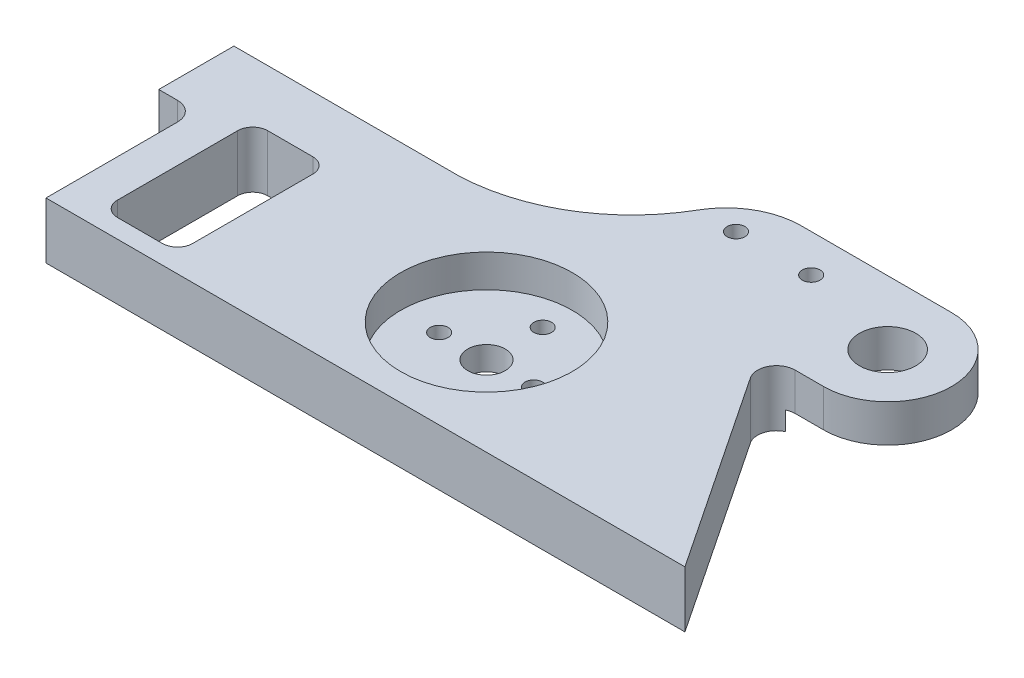
ISO-10303-21;
HEADER;
FILE_DESCRIPTION(('STEP AP214'),'2;1');
FILE_NAME('part.step','',(''),(''),'','','');
FILE_SCHEMA(('AUTOMOTIVE_DESIGN { 1 0 10303 214 1 1 1 1 }'));
ENDSEC;
DATA;
#1=APPLICATION_CONTEXT('core data for automotive mechanical design processes');
#2=APPLICATION_PROTOCOL_DEFINITION('international standard','automotive_design',2000,#1);
#3=PRODUCT_CONTEXT('',#1,'mechanical');
#4=PRODUCT('Part','Part','',(#3));
#5=PRODUCT_RELATED_PRODUCT_CATEGORY('part','',(#4));
#6=PRODUCT_DEFINITION_FORMATION('','',#4);
#7=PRODUCT_DEFINITION_CONTEXT('part definition',#1,'design');
#8=PRODUCT_DEFINITION('design','',#6,#7);
#9=PRODUCT_DEFINITION_SHAPE('','',#8);
#10=(LENGTH_UNIT() NAMED_UNIT(*) SI_UNIT(.MILLI.,.METRE.));
#11=(NAMED_UNIT(*) PLANE_ANGLE_UNIT() SI_UNIT($,.RADIAN.));
#12=(NAMED_UNIT(*) SI_UNIT($,.STERADIAN.) SOLID_ANGLE_UNIT());
#13=UNCERTAINTY_MEASURE_WITH_UNIT(LENGTH_MEASURE(1.E-05),#10,'distance_accuracy_value','');
#14=(GEOMETRIC_REPRESENTATION_CONTEXT(3) GLOBAL_UNCERTAINTY_ASSIGNED_CONTEXT((#13)) GLOBAL_UNIT_ASSIGNED_CONTEXT((#10,
#11,#12)) REPRESENTATION_CONTEXT('',''));
#15=CARTESIAN_POINT('',(0.,0.,0.));
#16=DIRECTION('',(0.,0.,1.));
#17=DIRECTION('',(1.,0.,0.));
#18=AXIS2_PLACEMENT_3D('',#15,#16,#17);
#19=CARTESIAN_POINT('',(99.6289220182295,9.525,-21.6319864480231));
#20=DIRECTION('',(0.,0.,1.));
#21=DIRECTION('',(1.,0.,0.));
#22=AXIS2_PLACEMENT_3D('',#19,#20,#21);
#23=PLANE('',#22);
#24=DIRECTION('',(0.,-1.,0.));
#25=VECTOR('',#24,1.);
#26=CARTESIAN_POINT('',(92.9727751915635,3.175,-21.6319864480231));
#27=LINE('',#26,#25);
#28=CARTESIAN_POINT('',(92.9727751915635,0.,-21.6319864480231));
#29=VERTEX_POINT('',#28);
#30=CARTESIAN_POINT('',(92.9727751915635,3.175,-21.6319864480231));
#31=VERTEX_POINT('',#30);
#32=EDGE_CURVE('E198',#29,#31,#27,.F.);
#33=ORIENTED_EDGE('',*,*,#32,.F.);
#34=DIRECTION('',(-1.,0.,0.));
#35=VECTOR('',#34,1.);
#36=CARTESIAN_POINT('',(99.6289220182295,0.,-21.6319864480231));
#37=LINE('',#36,#35);
#38=CARTESIAN_POINT('',(74.2289220182296,0.,-21.6319864480231));
#39=VERTEX_POINT('',#38);
#40=EDGE_CURVE('E212',#29,#39,#37,.T.);
#41=ORIENTED_EDGE('',*,*,#40,.T.);
#42=DIRECTION('',(0.,-1.,0.));
#43=VECTOR('',#42,1.);
#44=CARTESIAN_POINT('',(74.2289220182296,9.525,-21.6319864480231));
#45=LINE('',#44,#43);
#46=CARTESIAN_POINT('',(74.2289220182296,9.525,-21.6319864480231));
#47=VERTEX_POINT('',#46);
#48=EDGE_CURVE('E256',#47,#39,#45,.T.);
#49=ORIENTED_EDGE('',*,*,#48,.F.);
#50=DIRECTION('',(-1.,0.,0.));
#51=VECTOR('',#50,1.);
#52=CARTESIAN_POINT('',(99.6289220182295,9.525,-21.6319864480231));
#53=LINE('',#52,#51);
#54=CARTESIAN_POINT('',(99.6289220182295,9.525,-21.6319864480231));
#55=VERTEX_POINT('',#54);
#56=EDGE_CURVE('E503',#55,#47,#53,.T.);
#57=ORIENTED_EDGE('',*,*,#56,.F.);
#58=DIRECTION('',(0.,-1.,0.));
#59=VECTOR('',#58,1.);
#60=CARTESIAN_POINT('',(99.6289220182295,9.525,-21.6319864480231));
#61=LINE('',#60,#59);
#62=CARTESIAN_POINT('',(99.6289220182295,3.175,-21.6319864480231));
#63=VERTEX_POINT('',#62);
#64=EDGE_CURVE('E259',#55,#63,#61,.T.);
#65=ORIENTED_EDGE('',*,*,#64,.T.);
#66=DIRECTION('',(-1.,0.,0.));
#67=VECTOR('',#66,1.);
#68=CARTESIAN_POINT('',(99.6289220182295,3.175,-21.6319864480231));
#69=LINE('',#68,#67);
#70=EDGE_CURVE('E215',#63,#31,#69,.T.);
#71=ORIENTED_EDGE('',*,*,#70,.T.);
#72=EDGE_LOOP('',(#33,#41,#49,#57,#65,#71));
#73=FACE_BOUND('',#72,.T.);
#74=ADVANCED_FACE('F39',(#73),#23,.F.);
#75=CARTESIAN_POINT('',(94.8325417665327,9.525,3.175));
#76=DIRECTION('',(0.,1.,0.));
#77=DIRECTION('',(0.,0.,1.));
#78=AXIS2_PLACEMENT_3D('',#75,#76,#77);
#79=CYLINDRICAL_SURFACE('',#78,3.175);
#80=DIRECTION('',(0.,-1.,0.));
#81=VECTOR('',#80,1.);
#82=CARTESIAN_POINT('',(93.486164763583,1.5875,0.299605424306395));
#83=LINE('',#82,#81);
#84=CARTESIAN_POINT('',(93.486164763583,3.175,0.299605424306388));
#85=VERTEX_POINT('',#84);
#86=CARTESIAN_POINT('',(93.486164763583,0.,0.299605424306388));
#87=VERTEX_POINT('',#86);
#88=EDGE_CURVE('E201',#85,#87,#83,.T.);
#89=ORIENTED_EDGE('',*,*,#88,.F.);
#90=CARTESIAN_POINT('',(94.8325417665327,3.175,3.175));
#91=DIRECTION('',(0.,1.,0.));
#92=DIRECTION('',(0.,0.,1.));
#93=AXIS2_PLACEMENT_3D('',#90,#91,#92);
#94=CIRCLE('',#93,3.175);
#95=CARTESIAN_POINT('',(94.8325417665327,3.175,0.));
#96=VERTEX_POINT('',#95);
#97=EDGE_CURVE('E304',#85,#96,#94,.F.);
#98=ORIENTED_EDGE('',*,*,#97,.T.);
#99=DIRECTION('',(0.,-1.,0.));
#100=VECTOR('',#99,1.);
#101=CARTESIAN_POINT('',(94.8325417665327,0.,0.));
#102=LINE('',#101,#100);
#103=CARTESIAN_POINT('',(94.8325417665327,9.525,0.));
#104=VERTEX_POINT('',#103);
#105=EDGE_CURVE('E278',#104,#96,#102,.T.);
#106=ORIENTED_EDGE('',*,*,#105,.F.);
#107=CARTESIAN_POINT('',(94.8325417665327,9.525,3.175));
#108=DIRECTION('',(0.,-1.,0.));
#109=DIRECTION('',(0.,0.,-1.));
#110=AXIS2_PLACEMENT_3D('',#107,#108,#109);
#111=CIRCLE('',#110,3.175);
#112=CARTESIAN_POINT('',(92.1907820820101,9.525,4.9361731230151));
#113=VERTEX_POINT('',#112);
#114=EDGE_CURVE('E288',#113,#104,#111,.T.);
#115=ORIENTED_EDGE('',*,*,#114,.F.);
#116=DIRECTION('',(0.,-1.,0.));
#117=VECTOR('',#116,1.);
#118=CARTESIAN_POINT('',(92.1907820820101,9.525,4.9361731230151));
#119=LINE('',#118,#117);
#120=CARTESIAN_POINT('',(92.1907820820101,0.,4.9361731230151));
#121=VERTEX_POINT('',#120);
#122=EDGE_CURVE('E282',#121,#113,#119,.F.);
#123=ORIENTED_EDGE('',*,*,#122,.F.);
#124=CARTESIAN_POINT('',(94.8325417665327,0.,3.175));
#125=DIRECTION('',(0.,-1.,0.));
#126=DIRECTION('',(0.,0.,-1.));
#127=AXIS2_PLACEMENT_3D('',#124,#125,#126);
#128=CIRCLE('',#127,3.175);
#129=EDGE_CURVE('E285',#87,#121,#128,.F.);
#130=ORIENTED_EDGE('',*,*,#129,.F.);
#131=EDGE_LOOP('',(#89,#98,#106,#115,#123,#130));
#132=FACE_BOUND('',#131,.T.);
#133=ADVANCED_FACE('F537',(#132),#79,.F.);
#134=CARTESIAN_POINT('',(69.7204790438301,9.525,19.05));
#135=DIRECTION('',(0.,-1.,0.));
#136=DIRECTION('',(0.,0.,-1.));
#137=AXIS2_PLACEMENT_3D('',#134,#135,#136);
#138=CYLINDRICAL_SURFACE('',#137,1.5);
#139=CARTESIAN_POINT('',(69.7204790438301,0.,19.05));
#140=DIRECTION('',(0.,1.,0.));
#141=DIRECTION('',(0.,0.,1.));
#142=AXIS2_PLACEMENT_3D('',#139,#140,#141);
#143=CIRCLE('',#142,1.5);
#144=CARTESIAN_POINT('',(69.7204790438301,0.,20.55));
#145=VERTEX_POINT('',#144);
#146=EDGE_CURVE('E455',#145,#145,#143,.T.);
#147=ORIENTED_EDGE('',*,*,#146,.F.);
#148=EDGE_LOOP('',(#147));
#149=FACE_BOUND('',#148,.T.);
#150=CARTESIAN_POINT('',(69.7204790438301,4.,19.05));
#151=DIRECTION('',(0.,1.,0.));
#152=DIRECTION('',(0.,0.,1.));
#153=AXIS2_PLACEMENT_3D('',#150,#151,#152);
#154=CIRCLE('',#153,1.5);
#155=CARTESIAN_POINT('',(69.7204790438301,4.,20.55));
#156=VERTEX_POINT('',#155);
#157=EDGE_CURVE('E435',#156,#156,#154,.T.);
#158=ORIENTED_EDGE('',*,*,#157,.T.);
#159=EDGE_LOOP('',(#158));
#160=FACE_BOUND('',#159,.T.);
#161=ADVANCED_FACE('F577',(#149,#160),#138,.F.);
#162=CARTESIAN_POINT('',(61.7204790438301,9.525,28.55));
#163=DIRECTION('',(0.,-1.,0.));
#164=DIRECTION('',(0.,0.,-1.));
#165=AXIS2_PLACEMENT_3D('',#162,#163,#164);
#166=CYLINDRICAL_SURFACE('',#165,1.5);
#167=CARTESIAN_POINT('',(61.7204790438301,0.,28.55));
#168=DIRECTION('',(0.,1.,0.));
#169=DIRECTION('',(0.,0.,1.));
#170=AXIS2_PLACEMENT_3D('',#167,#168,#169);
#171=CIRCLE('',#170,1.5);
#172=CARTESIAN_POINT('',(61.7204790438301,0.,30.05));
#173=VERTEX_POINT('',#172);
#174=EDGE_CURVE('E451',#173,#173,#171,.T.);
#175=ORIENTED_EDGE('',*,*,#174,.F.);
#176=EDGE_LOOP('',(#175));
#177=FACE_BOUND('',#176,.T.);
#178=CARTESIAN_POINT('',(61.7204790438301,4.,28.55));
#179=DIRECTION('',(0.,1.,0.));
#180=DIRECTION('',(0.,0.,1.));
#181=AXIS2_PLACEMENT_3D('',#178,#179,#180);
#182=CIRCLE('',#181,1.5);
#183=CARTESIAN_POINT('',(61.7204790438301,4.,30.05));
#184=VERTEX_POINT('',#183);
#185=EDGE_CURVE('E431',#184,#184,#182,.T.);
#186=ORIENTED_EDGE('',*,*,#185,.T.);
#187=EDGE_LOOP('',(#186));
#188=FACE_BOUND('',#187,.T.);
#189=ADVANCED_FACE('F650',(#177,#188),#166,.F.);
#190=CARTESIAN_POINT('',(53.7204790438301,9.525,19.05));
#191=DIRECTION('',(0.,-1.,0.));
#192=DIRECTION('',(0.,0.,-1.));
#193=AXIS2_PLACEMENT_3D('',#190,#191,#192);
#194=CYLINDRICAL_SURFACE('',#193,1.5);
#195=CARTESIAN_POINT('',(53.7204790438301,0.,19.05));
#196=DIRECTION('',(0.,1.,0.));
#197=DIRECTION('',(0.,0.,1.));
#198=AXIS2_PLACEMENT_3D('',#195,#196,#197);
#199=CIRCLE('',#198,1.5);
#200=CARTESIAN_POINT('',(53.7204790438301,0.,20.55));
#201=VERTEX_POINT('',#200);
#202=EDGE_CURVE('E447',#201,#201,#199,.T.);
#203=ORIENTED_EDGE('',*,*,#202,.F.);
#204=EDGE_LOOP('',(#203));
#205=FACE_BOUND('',#204,.T.);
#206=CARTESIAN_POINT('',(53.7204790438301,4.,19.05));
#207=DIRECTION('',(0.,1.,0.));
#208=DIRECTION('',(0.,0.,1.));
#209=AXIS2_PLACEMENT_3D('',#206,#207,#208);
#210=CIRCLE('',#209,1.5);
#211=CARTESIAN_POINT('',(53.7204790438301,4.,20.55));
#212=VERTEX_POINT('',#211);
#213=EDGE_CURVE('E427',#212,#212,#210,.T.);
#214=ORIENTED_EDGE('',*,*,#213,.T.);
#215=EDGE_LOOP('',(#214));
#216=FACE_BOUND('',#215,.T.);
#217=ADVANCED_FACE('F646',(#205,#216),#194,.F.);
#218=CARTESIAN_POINT('',(61.7204790438301,9.525,9.55000000000001));
#219=DIRECTION('',(0.,-1.,0.));
#220=DIRECTION('',(0.,0.,-1.));
#221=AXIS2_PLACEMENT_3D('',#218,#219,#220);
#222=CYLINDRICAL_SURFACE('',#221,1.5);
#223=CARTESIAN_POINT('',(61.7204790438301,0.,9.55000000000001));
#224=DIRECTION('',(0.,1.,0.));
#225=DIRECTION('',(0.,0.,1.));
#226=AXIS2_PLACEMENT_3D('',#223,#224,#225);
#227=CIRCLE('',#226,1.5);
#228=CARTESIAN_POINT('',(61.7204790438301,0.,11.05));
#229=VERTEX_POINT('',#228);
#230=EDGE_CURVE('E443',#229,#229,#227,.T.);
#231=ORIENTED_EDGE('',*,*,#230,.F.);
#232=EDGE_LOOP('',(#231));
#233=FACE_BOUND('',#232,.T.);
#234=CARTESIAN_POINT('',(61.7204790438301,4.,9.55000000000001));
#235=DIRECTION('',(0.,1.,0.));
#236=DIRECTION('',(0.,0.,1.));
#237=AXIS2_PLACEMENT_3D('',#234,#235,#236);
#238=CIRCLE('',#237,1.5);
#239=CARTESIAN_POINT('',(61.7204790438301,4.,11.05));
#240=VERTEX_POINT('',#239);
#241=EDGE_CURVE('E309',#240,#240,#238,.T.);
#242=ORIENTED_EDGE('',*,*,#241,.T.);
#243=EDGE_LOOP('',(#242));
#244=FACE_BOUND('',#243,.T.);
#245=ADVANCED_FACE('F642',(#233,#244),#222,.F.);
#246=CARTESIAN_POINT('',(61.7204790438301,9.525,19.05));
#247=DIRECTION('',(0.,-1.,0.));
#248=DIRECTION('',(0.,0.,-1.));
#249=AXIS2_PLACEMENT_3D('',#246,#247,#248);
#250=CYLINDRICAL_SURFACE('',#249,3.175);
#251=CARTESIAN_POINT('',(61.7204790438301,0.,19.05));
#252=DIRECTION('',(0.,1.,0.));
#253=DIRECTION('',(0.,0.,1.));
#254=AXIS2_PLACEMENT_3D('',#251,#252,#253);
#255=CIRCLE('',#254,3.175);
#256=CARTESIAN_POINT('',(61.7204790438301,0.,22.225));
#257=VERTEX_POINT('',#256);
#258=EDGE_CURVE('E439',#257,#257,#255,.T.);
#259=ORIENTED_EDGE('',*,*,#258,.F.);
#260=EDGE_LOOP('',(#259));
#261=FACE_BOUND('',#260,.T.);
#262=CARTESIAN_POINT('',(61.7204790438301,4.,19.05));
#263=DIRECTION('',(0.,1.,0.));
#264=DIRECTION('',(0.,0.,1.));
#265=AXIS2_PLACEMENT_3D('',#262,#263,#264);
#266=CIRCLE('',#265,3.175);
#267=CARTESIAN_POINT('',(61.7204790438301,4.,22.225));
#268=VERTEX_POINT('',#267);
#269=EDGE_CURVE('E305',#268,#268,#266,.T.);
#270=ORIENTED_EDGE('',*,*,#269,.T.);
#271=EDGE_LOOP('',(#270));
#272=FACE_BOUND('',#271,.T.);
#273=ADVANCED_FACE('F639',(#261,#272),#250,.F.);
#274=CARTESIAN_POINT('',(36.7936206027921,9.525,-30.4519912792341));
#275=DIRECTION('',(0.,-1.,0.));
#276=DIRECTION('',(0.,0.,-1.));
#277=AXIS2_PLACEMENT_3D('',#274,#275,#276);
#278=PLANE('',#277);
#279=DIRECTION('',(1.,0.,0.));
#280=VECTOR('',#279,1.);
#281=CARTESIAN_POINT('',(12.7,9.525,9.52500000000002));
#282=LINE('',#281,#280);
#283=CARTESIAN_POINT('',(15.24,9.525,9.52500000000002));
#284=VERTEX_POINT('',#283);
#285=CARTESIAN_POINT('',(22.86,9.525,9.52500000000002));
#286=VERTEX_POINT('',#285);
#287=EDGE_CURVE('E381',#284,#286,#282,.T.);
#288=ORIENTED_EDGE('',*,*,#287,.T.);
#289=CARTESIAN_POINT('',(22.86,9.525,12.065));
#290=DIRECTION('',(0.,-1.,0.));
#291=DIRECTION('',(0.,0.,-1.));
#292=AXIS2_PLACEMENT_3D('',#289,#290,#291);
#293=CIRCLE('',#292,2.54);
#294=CARTESIAN_POINT('',(25.4,9.525,12.065));
#295=VERTEX_POINT('',#294);
#296=EDGE_CURVE('E358',#286,#295,#293,.T.);
#297=ORIENTED_EDGE('',*,*,#296,.T.);
#298=DIRECTION('',(0.,0.,1.));
#299=VECTOR('',#298,1.);
#300=CARTESIAN_POINT('',(25.4,9.525,9.52500000000002));
#301=LINE('',#300,#299);
#302=CARTESIAN_POINT('',(25.4,9.525,32.385));
#303=VERTEX_POINT('',#302);
#304=EDGE_CURVE('E207',#295,#303,#301,.T.);
#305=ORIENTED_EDGE('',*,*,#304,.T.);
#306=CARTESIAN_POINT('',(22.86,9.525,32.385));
#307=DIRECTION('',(0.,-1.,0.));
#308=DIRECTION('',(0.,0.,-1.));
#309=AXIS2_PLACEMENT_3D('',#306,#307,#308);
#310=CIRCLE('',#309,2.54);
#311=CARTESIAN_POINT('',(22.86,9.525,34.925));
#312=VERTEX_POINT('',#311);
#313=EDGE_CURVE('E346',#303,#312,#310,.T.);
#314=ORIENTED_EDGE('',*,*,#313,.T.);
#315=DIRECTION('',(-1.,0.,0.));
#316=VECTOR('',#315,1.);
#317=CARTESIAN_POINT('',(25.4,9.525,34.925));
#318=LINE('',#317,#316);
#319=CARTESIAN_POINT('',(15.24,9.525,34.925));
#320=VERTEX_POINT('',#319);
#321=EDGE_CURVE('E382',#312,#320,#318,.T.);
#322=ORIENTED_EDGE('',*,*,#321,.T.);
#323=CARTESIAN_POINT('',(15.24,9.525,32.385));
#324=DIRECTION('',(0.,-1.,0.));
#325=DIRECTION('',(0.,0.,-1.));
#326=AXIS2_PLACEMENT_3D('',#323,#324,#325);
#327=CIRCLE('',#326,2.54);
#328=CARTESIAN_POINT('',(12.7,9.525,32.385));
#329=VERTEX_POINT('',#328);
#330=EDGE_CURVE('E11',#320,#329,#327,.T.);
#331=ORIENTED_EDGE('',*,*,#330,.T.);
#332=DIRECTION('',(0.,0.,-1.));
#333=VECTOR('',#332,1.);
#334=CARTESIAN_POINT('',(12.7,9.525,34.925));
#335=LINE('',#334,#333);
#336=CARTESIAN_POINT('',(12.7,9.525,12.065));
#337=VERTEX_POINT('',#336);
#338=EDGE_CURVE('E378',#329,#337,#335,.T.);
#339=ORIENTED_EDGE('',*,*,#338,.T.);
#340=CARTESIAN_POINT('',(15.24,9.525,12.065));
#341=DIRECTION('',(0.,-1.,0.));
#342=DIRECTION('',(0.,0.,-1.));
#343=AXIS2_PLACEMENT_3D('',#340,#341,#342);
#344=CIRCLE('',#343,2.54);
#345=EDGE_CURVE('E352',#337,#284,#344,.T.);
#346=ORIENTED_EDGE('',*,*,#345,.T.);
#347=EDGE_LOOP('',(#288,#297,#305,#314,#322,#331,#339,#346));
#348=FACE_BOUND('',#347,.T.);
#349=CARTESIAN_POINT('',(61.7204790438301,9.525,19.05));
#350=DIRECTION('',(0.,1.,0.));
#351=DIRECTION('',(0.,0.,1.));
#352=AXIS2_PLACEMENT_3D('',#349,#350,#351);
#353=CIRCLE('',#352,14.5);
#354=CARTESIAN_POINT('',(61.7204790438301,9.525,33.55));
#355=VERTEX_POINT('',#354);
#356=EDGE_CURVE('E217',#355,#355,#353,.T.);
#357=ORIENTED_EDGE('',*,*,#356,.F.);
#358=EDGE_LOOP('',(#357));
#359=FACE_BOUND('',#358,.T.);
#360=DIRECTION('',(0.,0.,1.));
#361=VECTOR('',#360,1.);
#362=CARTESIAN_POINT('',(0.,9.525,12.7));
#363=LINE('',#362,#361);
#364=CARTESIAN_POINT('',(0.,9.525,0.));
#365=VERTEX_POINT('',#364);
#366=CARTESIAN_POINT('',(0.,9.525,12.7));
#367=VERTEX_POINT('',#366);
#368=EDGE_CURVE('E242',#365,#367,#363,.T.);
#369=ORIENTED_EDGE('',*,*,#368,.T.);
#370=DIRECTION('',(1.,0.,0.));
#371=VECTOR('',#370,1.);
#372=CARTESIAN_POINT('',(6.35,9.525,12.7));
#373=LINE('',#372,#371);
#374=CARTESIAN_POINT('',(3.175,9.525,12.7));
#375=VERTEX_POINT('',#374);
#376=EDGE_CURVE('E483',#367,#375,#373,.T.);
#377=ORIENTED_EDGE('',*,*,#376,.T.);
#378=CARTESIAN_POINT('',(3.175,9.525,15.875));
#379=DIRECTION('',(0.,-1.,0.));
#380=DIRECTION('',(0.,0.,-1.));
#381=AXIS2_PLACEMENT_3D('',#378,#379,#380);
#382=CIRCLE('',#381,3.175);
#383=CARTESIAN_POINT('',(6.35,9.525,15.875));
#384=VERTEX_POINT('',#383);
#385=EDGE_CURVE('E301',#375,#384,#382,.T.);
#386=ORIENTED_EDGE('',*,*,#385,.T.);
#387=DIRECTION('',(0.,0.,1.));
#388=VECTOR('',#387,1.);
#389=CARTESIAN_POINT('',(6.35,9.525,38.1));
#390=LINE('',#389,#388);
#391=CARTESIAN_POINT('',(6.35,9.525,38.1));
#392=VERTEX_POINT('',#391);
#393=EDGE_CURVE('E487',#384,#392,#390,.T.);
#394=ORIENTED_EDGE('',*,*,#393,.T.);
#395=DIRECTION('',(1.,0.,0.));
#396=VECTOR('',#395,1.);
#397=CARTESIAN_POINT('',(114.3,9.525,38.1));
#398=LINE('',#397,#396);
#399=CARTESIAN_POINT('',(114.3,9.525,38.1));
#400=VERTEX_POINT('',#399);
#401=EDGE_CURVE('E490',#392,#400,#398,.T.);
#402=ORIENTED_EDGE('',*,*,#401,.T.);
#403=DIRECTION('',(-0.554700196225229,0.,-0.832050294337844));
#404=VECTOR('',#403,1.);
#405=CARTESIAN_POINT('',(88.9,9.525,0.));
#406=LINE('',#405,#404);
#407=EDGE_CURVE('E493',#400,#113,#406,.T.);
#408=ORIENTED_EDGE('',*,*,#407,.T.);
#409=ORIENTED_EDGE('',*,*,#114,.T.);
#410=DIRECTION('',(1.,0.,0.));
#411=VECTOR('',#410,1.);
#412=CARTESIAN_POINT('',(99.6289220182295,9.525,0.));
#413=LINE('',#412,#411);
#414=CARTESIAN_POINT('',(99.6289220182295,9.525,0.));
#415=VERTEX_POINT('',#414);
#416=EDGE_CURVE('E497',#104,#415,#413,.T.);
#417=ORIENTED_EDGE('',*,*,#416,.T.);
#418=CARTESIAN_POINT('',(99.6289220182295,9.525,-10.8159932240115));
#419=DIRECTION('',(0.,1.,0.));
#420=DIRECTION('',(0.,0.,-1.));
#421=AXIS2_PLACEMENT_3D('',#418,#419,#420);
#422=CIRCLE('',#421,10.8159932240115);
#423=EDGE_CURVE('E500',#415,#55,#422,.T.);
#424=ORIENTED_EDGE('',*,*,#423,.T.);
#425=ORIENTED_EDGE('',*,*,#56,.T.);
#426=CARTESIAN_POINT('',(74.2289220182296,9.525,-8.93198644802308));
#427=DIRECTION('',(0.,1.,0.));
#428=DIRECTION('',(0.,0.,1.));
#429=AXIS2_PLACEMENT_3D('',#426,#427,#428);
#430=CIRCLE('',#429,12.7);
#431=CARTESIAN_POINT('',(63.2185392489832,9.525,-15.2613996336734));
#432=VERTEX_POINT('',#431);
#433=EDGE_CURVE('E506',#47,#432,#430,.T.);
#434=ORIENTED_EDGE('',*,*,#433,.T.);
#435=CARTESIAN_POINT('',(36.7936206027921,9.525,-30.4519912792341));
#436=DIRECTION('',(0.,-1.,0.));
#437=DIRECTION('',(0.,0.,-1.));
#438=AXIS2_PLACEMENT_3D('',#435,#436,#437);
#439=CIRCLE('',#438,30.48);
#440=CARTESIAN_POINT('',(38.1,9.525,0.));
#441=VERTEX_POINT('',#440);
#442=EDGE_CURVE('E509',#432,#441,#439,.T.);
#443=ORIENTED_EDGE('',*,*,#442,.T.);
#444=DIRECTION('',(-1.,0.,0.));
#445=VECTOR('',#444,1.);
#446=CARTESIAN_POINT('',(0.,9.525,0.));
#447=LINE('',#446,#445);
#448=EDGE_CURVE('E248',#441,#365,#447,.T.);
#449=ORIENTED_EDGE('',*,*,#448,.T.);
#450=EDGE_LOOP('',(#369,#377,#386,#394,#402,#408,#409,#417,#424,#425,#434,#443,#449));
#451=FACE_BOUND('',#450,.T.);
#452=CARTESIAN_POINT('',(99.6289220182295,9.525,-10.8159932240115));
#453=DIRECTION('',(0.,1.,0.));
#454=DIRECTION('',(0.,0.,1.));
#455=AXIS2_PLACEMENT_3D('',#452,#453,#454);
#456=CIRCLE('',#455,4.76250000000001);
#457=CARTESIAN_POINT('',(99.6289220182295,9.525,-6.05349322401153));
#458=VERTEX_POINT('',#457);
#459=EDGE_CURVE('E472',#458,#458,#456,.T.);
#460=ORIENTED_EDGE('',*,*,#459,.F.);
#461=EDGE_LOOP('',(#460));
#462=FACE_BOUND('',#461,.T.);
#463=CARTESIAN_POINT('',(69.5685392489832,9.525,-15.2613996336734));
#464=DIRECTION('',(0.,1.,0.));
#465=DIRECTION('',(0.,0.,1.));
#466=AXIS2_PLACEMENT_3D('',#463,#464,#465);
#467=CIRCLE('',#466,1.5);
#468=CARTESIAN_POINT('',(69.5685392489832,9.525,-13.7613996336734));
#469=VERTEX_POINT('',#468);
#470=EDGE_CURVE('E468',#469,#469,#467,.T.);
#471=ORIENTED_EDGE('',*,*,#470,.F.);
#472=EDGE_LOOP('',(#471));
#473=FACE_BOUND('',#472,.T.);
#474=CARTESIAN_POINT('',(82.2685392489832,9.525,-15.2613996336734));
#475=DIRECTION('',(0.,1.,0.));
#476=DIRECTION('',(0.,0.,1.));
#477=AXIS2_PLACEMENT_3D('',#474,#475,#476);
#478=CIRCLE('',#477,1.5);
#479=CARTESIAN_POINT('',(82.2685392489832,9.525,-13.7613996336734));
#480=VERTEX_POINT('',#479);
#481=EDGE_CURVE('E460',#480,#480,#478,.T.);
#482=ORIENTED_EDGE('',*,*,#481,.F.);
#483=EDGE_LOOP('',(#482));
#484=FACE_BOUND('',#483,.T.);
#485=ADVANCED_FACE('F541',(#348,#359,#451,#462,#473,#484),#278,.F.);
#486=CARTESIAN_POINT('',(36.7936206027921,0.,-30.4519912792341));
#487=DIRECTION('',(0.,-1.,0.));
#488=DIRECTION('',(0.,0.,-1.));
#489=AXIS2_PLACEMENT_3D('',#486,#487,#488);
#490=PLANE('',#489);
#491=DIRECTION('',(-1.,0.,0.));
#492=VECTOR('',#491,1.);
#493=CARTESIAN_POINT('',(25.4,0.,34.925));
#494=LINE('',#493,#492);
#495=CARTESIAN_POINT('',(22.86,0.,34.925));
#496=VERTEX_POINT('',#495);
#497=CARTESIAN_POINT('',(15.24,0.,34.925));
#498=VERTEX_POINT('',#497);
#499=EDGE_CURVE('E366',#496,#498,#494,.T.);
#500=ORIENTED_EDGE('',*,*,#499,.F.);
#501=CARTESIAN_POINT('',(22.86,0.,32.385));
#502=DIRECTION('',(0.,-1.,0.));
#503=DIRECTION('',(0.,0.,-1.));
#504=AXIS2_PLACEMENT_3D('',#501,#502,#503);
#505=CIRCLE('',#504,2.54);
#506=CARTESIAN_POINT('',(25.4,0.,32.385));
#507=VERTEX_POINT('',#506);
#508=EDGE_CURVE('E343',#496,#507,#505,.F.);
#509=ORIENTED_EDGE('',*,*,#508,.T.);
#510=DIRECTION('',(0.,0.,1.));
#511=VECTOR('',#510,1.);
#512=CARTESIAN_POINT('',(25.4,0.,9.52500000000002));
#513=LINE('',#512,#511);
#514=CARTESIAN_POINT('',(25.4,0.,12.065));
#515=VERTEX_POINT('',#514);
#516=EDGE_CURVE('E388',#515,#507,#513,.T.);
#517=ORIENTED_EDGE('',*,*,#516,.F.);
#518=CARTESIAN_POINT('',(22.86,0.,12.065));
#519=DIRECTION('',(0.,-1.,0.));
#520=DIRECTION('',(0.,0.,-1.));
#521=AXIS2_PLACEMENT_3D('',#518,#519,#520);
#522=CIRCLE('',#521,2.54);
#523=CARTESIAN_POINT('',(22.86,0.,9.52500000000002));
#524=VERTEX_POINT('',#523);
#525=EDGE_CURVE('E355',#515,#524,#522,.F.);
#526=ORIENTED_EDGE('',*,*,#525,.T.);
#527=DIRECTION('',(1.,0.,0.));
#528=VECTOR('',#527,1.);
#529=CARTESIAN_POINT('',(12.7,0.,9.52500000000002));
#530=LINE('',#529,#528);
#531=CARTESIAN_POINT('',(15.24,0.,9.52500000000002));
#532=VERTEX_POINT('',#531);
#533=EDGE_CURVE('E396',#532,#524,#530,.T.);
#534=ORIENTED_EDGE('',*,*,#533,.F.);
#535=CARTESIAN_POINT('',(15.24,0.,12.065));
#536=DIRECTION('',(0.,-1.,0.));
#537=DIRECTION('',(0.,0.,-1.));
#538=AXIS2_PLACEMENT_3D('',#535,#536,#537);
#539=CIRCLE('',#538,2.54);
#540=CARTESIAN_POINT('',(12.7,0.,12.065));
#541=VERTEX_POINT('',#540);
#542=EDGE_CURVE('E349',#532,#541,#539,.F.);
#543=ORIENTED_EDGE('',*,*,#542,.T.);
#544=DIRECTION('',(0.,0.,-1.));
#545=VECTOR('',#544,1.);
#546=CARTESIAN_POINT('',(12.7,0.,34.925));
#547=LINE('',#546,#545);
#548=CARTESIAN_POINT('',(12.7,0.,32.385));
#549=VERTEX_POINT('',#548);
#550=EDGE_CURVE('E367',#549,#541,#547,.T.);
#551=ORIENTED_EDGE('',*,*,#550,.F.);
#552=CARTESIAN_POINT('',(15.24,0.,32.385));
#553=DIRECTION('',(0.,-1.,0.));
#554=DIRECTION('',(0.,0.,-1.));
#555=AXIS2_PLACEMENT_3D('',#552,#553,#554);
#556=CIRCLE('',#555,2.54);
#557=EDGE_CURVE('E48',#549,#498,#556,.F.);
#558=ORIENTED_EDGE('',*,*,#557,.T.);
#559=EDGE_LOOP('',(#500,#509,#517,#526,#534,#543,#551,#558));
#560=FACE_BOUND('',#559,.T.);
#561=ORIENTED_EDGE('',*,*,#230,.T.);
#562=EDGE_LOOP('',(#561));
#563=FACE_BOUND('',#562,.T.);
#564=ORIENTED_EDGE('',*,*,#174,.T.);
#565=EDGE_LOOP('',(#564));
#566=FACE_BOUND('',#565,.T.);
#567=CARTESIAN_POINT('',(82.2685392489832,0.,-15.2613996336734));
#568=DIRECTION('',(0.,1.,0.));
#569=DIRECTION('',(0.,0.,1.));
#570=AXIS2_PLACEMENT_3D('',#567,#568,#569);
#571=CIRCLE('',#570,1.5);
#572=CARTESIAN_POINT('',(82.2685392489832,0.,-13.7613996336734));
#573=VERTEX_POINT('',#572);
#574=EDGE_CURVE('E459',#573,#573,#571,.T.);
#575=ORIENTED_EDGE('',*,*,#574,.T.);
#576=EDGE_LOOP('',(#575));
#577=FACE_BOUND('',#576,.T.);
#578=ORIENTED_EDGE('',*,*,#40,.F.);
#579=CARTESIAN_POINT('',(99.6289220182295,0.,-10.8159932240115));
#580=DIRECTION('',(0.,1.,0.));
#581=DIRECTION('',(0.,0.,1.));
#582=AXIS2_PLACEMENT_3D('',#579,#580,#581);
#583=CIRCLE('',#582,12.7);
#584=EDGE_CURVE('E194',#29,#87,#583,.T.);
#585=ORIENTED_EDGE('',*,*,#584,.T.);
#586=ORIENTED_EDGE('',*,*,#129,.T.);
#587=DIRECTION('',(-0.554700196225229,0.,-0.832050294337844));
#588=VECTOR('',#587,1.);
#589=CARTESIAN_POINT('',(88.9,0.,0.));
#590=LINE('',#589,#588);
#591=CARTESIAN_POINT('',(114.3,0.,38.1));
#592=VERTEX_POINT('',#591);
#593=EDGE_CURVE('E226',#592,#121,#590,.T.);
#594=ORIENTED_EDGE('',*,*,#593,.F.);
#595=DIRECTION('',(1.,0.,0.));
#596=VECTOR('',#595,1.);
#597=CARTESIAN_POINT('',(114.3,0.,38.1));
#598=LINE('',#597,#596);
#599=CARTESIAN_POINT('',(6.35,0.,38.1));
#600=VERTEX_POINT('',#599);
#601=EDGE_CURVE('E233',#600,#592,#598,.T.);
#602=ORIENTED_EDGE('',*,*,#601,.F.);
#603=DIRECTION('',(0.,0.,1.));
#604=VECTOR('',#603,1.);
#605=CARTESIAN_POINT('',(6.35,0.,38.1));
#606=LINE('',#605,#604);
#607=CARTESIAN_POINT('',(6.35,0.,15.875));
#608=VERTEX_POINT('',#607);
#609=EDGE_CURVE('E521',#608,#600,#606,.T.);
#610=ORIENTED_EDGE('',*,*,#609,.F.);
#611=CARTESIAN_POINT('',(3.175,0.,15.875));
#612=DIRECTION('',(0.,-1.,0.));
#613=DIRECTION('',(0.,0.,-1.));
#614=AXIS2_PLACEMENT_3D('',#611,#612,#613);
#615=CIRCLE('',#614,3.175);
#616=CARTESIAN_POINT('',(3.175,0.,12.7));
#617=VERTEX_POINT('',#616);
#618=EDGE_CURVE('E298',#608,#617,#615,.F.);
#619=ORIENTED_EDGE('',*,*,#618,.T.);
#620=DIRECTION('',(1.,0.,0.));
#621=VECTOR('',#620,1.);
#622=CARTESIAN_POINT('',(6.35,0.,12.7));
#623=LINE('',#622,#621);
#624=CARTESIAN_POINT('',(0.,0.,12.7));
#625=VERTEX_POINT('',#624);
#626=EDGE_CURVE('E517',#625,#617,#623,.T.);
#627=ORIENTED_EDGE('',*,*,#626,.F.);
#628=DIRECTION('',(0.,0.,1.));
#629=VECTOR('',#628,1.);
#630=CARTESIAN_POINT('',(0.,0.,12.7));
#631=LINE('',#630,#629);
#632=CARTESIAN_POINT('',(0.,0.,0.));
#633=VERTEX_POINT('',#632);
#634=EDGE_CURVE('E479',#633,#625,#631,.T.);
#635=ORIENTED_EDGE('',*,*,#634,.F.);
#636=DIRECTION('',(-1.,0.,0.));
#637=VECTOR('',#636,1.);
#638=CARTESIAN_POINT('',(0.,0.,0.));
#639=LINE('',#638,#637);
#640=CARTESIAN_POINT('',(38.1,0.,0.));
#641=VERTEX_POINT('',#640);
#642=EDGE_CURVE('E239',#641,#633,#639,.T.);
#643=ORIENTED_EDGE('',*,*,#642,.F.);
#644=CARTESIAN_POINT('',(36.7936206027921,0.,-30.4519912792341));
#645=DIRECTION('',(0.,-1.,0.));
#646=DIRECTION('',(0.,0.,-1.));
#647=AXIS2_PLACEMENT_3D('',#644,#645,#646);
#648=CIRCLE('',#647,30.48);
#649=CARTESIAN_POINT('',(63.2185392489832,0.,-15.2613996336734));
#650=VERTEX_POINT('',#649);
#651=EDGE_CURVE('E230',#650,#641,#648,.T.);
#652=ORIENTED_EDGE('',*,*,#651,.F.);
#653=CARTESIAN_POINT('',(74.2289220182296,0.,-8.93198644802308));
#654=DIRECTION('',(0.,1.,0.));
#655=DIRECTION('',(0.,0.,1.));
#656=AXIS2_PLACEMENT_3D('',#653,#654,#655);
#657=CIRCLE('',#656,12.7);
#658=EDGE_CURVE('E224',#39,#650,#657,.T.);
#659=ORIENTED_EDGE('',*,*,#658,.F.);
#660=EDGE_LOOP('',(#578,#585,#586,#594,#602,#610,#619,#627,#635,#643,#652,#659));
#661=FACE_BOUND('',#660,.T.);
#662=CARTESIAN_POINT('',(69.5685392489832,0.,-15.2613996336734));
#663=DIRECTION('',(0.,1.,0.));
#664=DIRECTION('',(0.,0.,1.));
#665=AXIS2_PLACEMENT_3D('',#662,#663,#664);
#666=CIRCLE('',#665,1.5);
#667=CARTESIAN_POINT('',(69.5685392489832,0.,-13.7613996336734));
#668=VERTEX_POINT('',#667);
#669=EDGE_CURVE('E464',#668,#668,#666,.T.);
#670=ORIENTED_EDGE('',*,*,#669,.T.);
#671=EDGE_LOOP('',(#670));
#672=FACE_BOUND('',#671,.T.);
#673=ORIENTED_EDGE('',*,*,#146,.T.);
#674=EDGE_LOOP('',(#673));
#675=FACE_BOUND('',#674,.T.);
#676=ORIENTED_EDGE('',*,*,#202,.T.);
#677=EDGE_LOOP('',(#676));
#678=FACE_BOUND('',#677,.T.);
#679=ORIENTED_EDGE('',*,*,#258,.T.);
#680=EDGE_LOOP('',(#679));
#681=FACE_BOUND('',#680,.T.);
#682=ADVANCED_FACE('F221',(#560,#563,#566,#577,#661,#672,#675,#678,#681),#490,.T.);
#683=CARTESIAN_POINT('',(0.,9.525,12.7));
#684=DIRECTION('',(1.,0.,0.));
#685=DIRECTION('',(0.,0.,-1.));
#686=AXIS2_PLACEMENT_3D('',#683,#684,#685);
#687=PLANE('',#686);
#688=ORIENTED_EDGE('',*,*,#634,.T.);
#689=DIRECTION('',(0.,-1.,0.));
#690=VECTOR('',#689,1.);
#691=CARTESIAN_POINT('',(0.,9.525,12.7));
#692=LINE('',#691,#690);
#693=EDGE_CURVE('E274',#367,#625,#692,.T.);
#694=ORIENTED_EDGE('',*,*,#693,.F.);
#695=ORIENTED_EDGE('',*,*,#368,.F.);
#696=DIRECTION('',(0.,-1.,0.));
#697=VECTOR('',#696,1.);
#698=CARTESIAN_POINT('',(0.,9.525,0.));
#699=LINE('',#698,#697);
#700=EDGE_CURVE('E243',#365,#633,#699,.T.);
#701=ORIENTED_EDGE('',*,*,#700,.T.);
#702=EDGE_LOOP('',(#688,#694,#695,#701));
#703=FACE_BOUND('',#702,.T.);
#704=ADVANCED_FACE('F598',(#703),#687,.F.);
#705=CARTESIAN_POINT('',(6.35,9.525,12.7));
#706=DIRECTION('',(0.,0.,-1.));
#707=DIRECTION('',(-1.,0.,0.));
#708=AXIS2_PLACEMENT_3D('',#705,#706,#707);
#709=PLANE('',#708);
#710=ORIENTED_EDGE('',*,*,#626,.T.);
#711=DIRECTION('',(0.,-1.,0.));
#712=VECTOR('',#711,1.);
#713=CARTESIAN_POINT('',(3.175,9.525,12.7));
#714=LINE('',#713,#712);
#715=EDGE_CURVE('E295',#617,#375,#714,.F.);
#716=ORIENTED_EDGE('',*,*,#715,.T.);
#717=ORIENTED_EDGE('',*,*,#376,.F.);
#718=ORIENTED_EDGE('',*,*,#693,.T.);
#719=EDGE_LOOP('',(#710,#716,#717,#718));
#720=FACE_BOUND('',#719,.T.);
#721=ADVANCED_FACE('F553',(#720),#709,.F.);
#722=CARTESIAN_POINT('',(6.35,9.525,38.1));
#723=DIRECTION('',(1.,0.,0.));
#724=DIRECTION('',(0.,0.,-1.));
#725=AXIS2_PLACEMENT_3D('',#722,#723,#724);
#726=PLANE('',#725);
#727=ORIENTED_EDGE('',*,*,#393,.F.);
#728=DIRECTION('',(0.,-1.,0.));
#729=VECTOR('',#728,1.);
#730=CARTESIAN_POINT('',(6.35,0.,15.875));
#731=LINE('',#730,#729);
#732=EDGE_CURVE('E291',#384,#608,#731,.T.);
#733=ORIENTED_EDGE('',*,*,#732,.T.);
#734=ORIENTED_EDGE('',*,*,#609,.T.);
#735=DIRECTION('',(0.,-1.,0.));
#736=VECTOR('',#735,1.);
#737=CARTESIAN_POINT('',(6.35,9.525,38.1));
#738=LINE('',#737,#736);
#739=EDGE_CURVE('E270',#392,#600,#738,.T.);
#740=ORIENTED_EDGE('',*,*,#739,.F.);
#741=EDGE_LOOP('',(#727,#733,#734,#740));
#742=FACE_BOUND('',#741,.T.);
#743=ADVANCED_FACE('F548',(#742),#726,.F.);
#744=CARTESIAN_POINT('',(114.3,9.525,38.1));
#745=DIRECTION('',(0.,0.,-1.));
#746=DIRECTION('',(-1.,0.,0.));
#747=AXIS2_PLACEMENT_3D('',#744,#745,#746);
#748=PLANE('',#747);
#749=ORIENTED_EDGE('',*,*,#601,.T.);
#750=DIRECTION('',(0.,-1.,0.));
#751=VECTOR('',#750,1.);
#752=CARTESIAN_POINT('',(114.3,9.525,38.1));
#753=LINE('',#752,#751);
#754=EDGE_CURVE('E266',#400,#592,#753,.T.);
#755=ORIENTED_EDGE('',*,*,#754,.F.);
#756=ORIENTED_EDGE('',*,*,#401,.F.);
#757=ORIENTED_EDGE('',*,*,#739,.T.);
#758=EDGE_LOOP('',(#749,#755,#756,#757));
#759=FACE_BOUND('',#758,.T.);
#760=ADVANCED_FACE('F527',(#759),#748,.F.);
#761=CARTESIAN_POINT('',(88.9,9.525,0.));
#762=DIRECTION('',(-0.832050294337844,0.,0.554700196225229));
#763=DIRECTION('',(0.554700196225229,0.,0.832050294337844));
#764=AXIS2_PLACEMENT_3D('',#761,#762,#763);
#765=PLANE('',#764);
#766=ORIENTED_EDGE('',*,*,#593,.T.);
#767=ORIENTED_EDGE('',*,*,#122,.T.);
#768=ORIENTED_EDGE('',*,*,#407,.F.);
#769=ORIENTED_EDGE('',*,*,#754,.T.);
#770=EDGE_LOOP('',(#766,#767,#768,#769));
#771=FACE_BOUND('',#770,.T.);
#772=ADVANCED_FACE('F534',(#771),#765,.F.);
#773=CARTESIAN_POINT('',(99.6289220182295,9.525,0.));
#774=DIRECTION('',(0.,0.,-1.));
#775=DIRECTION('',(-1.,0.,0.));
#776=AXIS2_PLACEMENT_3D('',#773,#774,#775);
#777=PLANE('',#776);
#778=ORIENTED_EDGE('',*,*,#105,.T.);
#779=DIRECTION('',(1.,0.,0.));
#780=VECTOR('',#779,1.);
#781=CARTESIAN_POINT('',(99.6289220182295,3.175,0.));
#782=LINE('',#781,#780);
#783=CARTESIAN_POINT('',(99.6289220182295,3.175,0.));
#784=VERTEX_POINT('',#783);
#785=EDGE_CURVE('E404',#96,#784,#782,.T.);
#786=ORIENTED_EDGE('',*,*,#785,.T.);
#787=DIRECTION('',(0.,-1.,0.));
#788=VECTOR('',#787,1.);
#789=CARTESIAN_POINT('',(99.6289220182295,9.525,0.));
#790=LINE('',#789,#788);
#791=EDGE_CURVE('E262',#415,#784,#790,.T.);
#792=ORIENTED_EDGE('',*,*,#791,.F.);
#793=ORIENTED_EDGE('',*,*,#416,.F.);
#794=EDGE_LOOP('',(#778,#786,#792,#793));
#795=FACE_BOUND('',#794,.T.);
#796=ADVANCED_FACE('F585',(#795),#777,.F.);
#797=CARTESIAN_POINT('',(99.6289220182295,9.525,-10.8159932240115));
#798=DIRECTION('',(0.,-1.,0.));
#799=DIRECTION('',(0.,0.,-1.));
#800=AXIS2_PLACEMENT_3D('',#797,#798,#799);
#801=CYLINDRICAL_SURFACE('',#800,10.8159932240115);
#802=ORIENTED_EDGE('',*,*,#791,.T.);
#803=CARTESIAN_POINT('',(99.6289220182295,3.175,-10.8159932240115));
#804=DIRECTION('',(0.,1.,0.));
#805=DIRECTION('',(0.,0.,1.));
#806=AXIS2_PLACEMENT_3D('',#803,#804,#805);
#807=CIRCLE('',#806,10.8159932240115);
#808=EDGE_CURVE('E409',#784,#63,#807,.T.);
#809=ORIENTED_EDGE('',*,*,#808,.T.);
#810=ORIENTED_EDGE('',*,*,#64,.F.);
#811=ORIENTED_EDGE('',*,*,#423,.F.);
#812=EDGE_LOOP('',(#802,#809,#810,#811));
#813=FACE_BOUND('',#812,.T.);
#814=ADVANCED_FACE('F582',(#813),#801,.T.);
#815=CARTESIAN_POINT('',(74.2289220182296,9.525,-8.93198644802308));
#816=DIRECTION('',(0.,-1.,0.));
#817=DIRECTION('',(0.,0.,-1.));
#818=AXIS2_PLACEMENT_3D('',#815,#816,#817);
#819=CYLINDRICAL_SURFACE('',#818,12.7);
#820=ORIENTED_EDGE('',*,*,#658,.T.);
#821=DIRECTION('',(0.,-1.,0.));
#822=VECTOR('',#821,1.);
#823=CARTESIAN_POINT('',(63.2185392489832,9.525,-15.2613996336734));
#824=LINE('',#823,#822);
#825=EDGE_CURVE('E252',#432,#650,#824,.T.);
#826=ORIENTED_EDGE('',*,*,#825,.F.);
#827=ORIENTED_EDGE('',*,*,#433,.F.);
#828=ORIENTED_EDGE('',*,*,#48,.T.);
#829=EDGE_LOOP('',(#820,#826,#827,#828));
#830=FACE_BOUND('',#829,.T.);
#831=ADVANCED_FACE('F580',(#830),#819,.T.);
#832=CARTESIAN_POINT('',(36.7936206027921,9.525,-30.4519912792341));
#833=DIRECTION('',(0.,-1.,0.));
#834=DIRECTION('',(0.,0.,-1.));
#835=AXIS2_PLACEMENT_3D('',#832,#833,#834);
#836=CYLINDRICAL_SURFACE('',#835,30.48);
#837=ORIENTED_EDGE('',*,*,#651,.T.);
#838=DIRECTION('',(0.,-1.,0.));
#839=VECTOR('',#838,1.);
#840=CARTESIAN_POINT('',(38.1,9.525,0.));
#841=LINE('',#840,#839);
#842=EDGE_CURVE('E247',#441,#641,#841,.T.);
#843=ORIENTED_EDGE('',*,*,#842,.F.);
#844=ORIENTED_EDGE('',*,*,#442,.F.);
#845=ORIENTED_EDGE('',*,*,#825,.T.);
#846=EDGE_LOOP('',(#837,#843,#844,#845));
#847=FACE_BOUND('',#846,.T.);
#848=ADVANCED_FACE('F614',(#847),#836,.F.);
#849=CARTESIAN_POINT('',(0.,9.525,0.));
#850=DIRECTION('',(0.,0.,1.));
#851=DIRECTION('',(1.,0.,0.));
#852=AXIS2_PLACEMENT_3D('',#849,#850,#851);
#853=PLANE('',#852);
#854=ORIENTED_EDGE('',*,*,#642,.T.);
#855=ORIENTED_EDGE('',*,*,#700,.F.);
#856=ORIENTED_EDGE('',*,*,#448,.F.);
#857=ORIENTED_EDGE('',*,*,#842,.T.);
#858=EDGE_LOOP('',(#854,#855,#856,#857));
#859=FACE_BOUND('',#858,.T.);
#860=ADVANCED_FACE('F609',(#859),#853,.F.);
#861=CARTESIAN_POINT('',(99.6289220182295,9.525,-10.8159932240115));
#862=DIRECTION('',(0.,-1.,0.));
#863=DIRECTION('',(0.,0.,-1.));
#864=AXIS2_PLACEMENT_3D('',#861,#862,#863);
#865=CYLINDRICAL_SURFACE('',#864,4.76250000000001);
#866=CARTESIAN_POINT('',(99.6289220182295,3.175,-10.8159932240115));
#867=DIRECTION('',(0.,1.,0.));
#868=DIRECTION('',(0.,0.,1.));
#869=AXIS2_PLACEMENT_3D('',#866,#867,#868);
#870=CIRCLE('',#869,4.76250000000001);
#871=CARTESIAN_POINT('',(99.6289220182295,3.175,-6.05349322401153));
#872=VERTEX_POINT('',#871);
#873=EDGE_CURVE('E218',#872,#872,#870,.T.);
#874=ORIENTED_EDGE('',*,*,#873,.F.);
#875=EDGE_LOOP('',(#874));
#876=FACE_BOUND('',#875,.T.);
#877=ORIENTED_EDGE('',*,*,#459,.T.);
#878=EDGE_LOOP('',(#877));
#879=FACE_BOUND('',#878,.T.);
#880=ADVANCED_FACE('F660',(#876,#879),#865,.F.);
#881=CARTESIAN_POINT('',(69.5685392489832,9.525,-15.2613996336734));
#882=DIRECTION('',(0.,-1.,0.));
#883=DIRECTION('',(0.,0.,-1.));
#884=AXIS2_PLACEMENT_3D('',#881,#882,#883);
#885=CYLINDRICAL_SURFACE('',#884,1.5);
#886=ORIENTED_EDGE('',*,*,#470,.T.);
#887=EDGE_LOOP('',(#886));
#888=FACE_BOUND('',#887,.T.);
#889=ORIENTED_EDGE('',*,*,#669,.F.);
#890=EDGE_LOOP('',(#889));
#891=FACE_BOUND('',#890,.T.);
#892=ADVANCED_FACE('F567',(#888,#891),#885,.F.);
#893=CARTESIAN_POINT('',(82.2685392489832,9.525,-15.2613996336734));
#894=DIRECTION('',(0.,-1.,0.));
#895=DIRECTION('',(0.,0.,-1.));
#896=AXIS2_PLACEMENT_3D('',#893,#894,#895);
#897=CYLINDRICAL_SURFACE('',#896,1.5);
#898=ORIENTED_EDGE('',*,*,#481,.T.);
#899=EDGE_LOOP('',(#898));
#900=FACE_BOUND('',#899,.T.);
#901=ORIENTED_EDGE('',*,*,#574,.F.);
#902=EDGE_LOOP('',(#901));
#903=FACE_BOUND('',#902,.T.);
#904=ADVANCED_FACE('F558',(#900,#903),#897,.F.);
#905=CARTESIAN_POINT('',(3.175,9.525,15.875));
#906=DIRECTION('',(0.,1.,0.));
#907=DIRECTION('',(0.,0.,1.));
#908=AXIS2_PLACEMENT_3D('',#905,#906,#907);
#909=CYLINDRICAL_SURFACE('',#908,3.175);
#910=ORIENTED_EDGE('',*,*,#385,.F.);
#911=ORIENTED_EDGE('',*,*,#715,.F.);
#912=ORIENTED_EDGE('',*,*,#618,.F.);
#913=ORIENTED_EDGE('',*,*,#732,.F.);
#914=EDGE_LOOP('',(#910,#911,#912,#913));
#915=FACE_BOUND('',#914,.T.);
#916=ADVANCED_FACE('F555',(#915),#909,.F.);
#917=CARTESIAN_POINT('',(61.7204790438301,4.,19.05));
#918=DIRECTION('',(0.,1.,0.));
#919=DIRECTION('',(0.,0.,1.));
#920=AXIS2_PLACEMENT_3D('',#917,#918,#919);
#921=CYLINDRICAL_SURFACE('',#920,14.5);
#922=CARTESIAN_POINT('',(61.7204790438301,4.,19.05));
#923=DIRECTION('',(0.,1.,0.));
#924=DIRECTION('',(0.,0.,1.));
#925=AXIS2_PLACEMENT_3D('',#922,#923,#924);
#926=CIRCLE('',#925,14.5);
#927=CARTESIAN_POINT('',(61.7204790438301,4.,33.55));
#928=VERTEX_POINT('',#927);
#929=EDGE_CURVE('E310',#928,#928,#926,.T.);
#930=ORIENTED_EDGE('',*,*,#929,.F.);
#931=EDGE_LOOP('',(#930));
#932=FACE_BOUND('',#931,.T.);
#933=ORIENTED_EDGE('',*,*,#356,.T.);
#934=EDGE_LOOP('',(#933));
#935=FACE_BOUND('',#934,.T.);
#936=ADVANCED_FACE('F557',(#932,#935),#921,.F.);
#937=CARTESIAN_POINT('',(61.7204790438301,4.,19.05));
#938=DIRECTION('',(0.,1.,0.));
#939=DIRECTION('',(0.,0.,1.));
#940=AXIS2_PLACEMENT_3D('',#937,#938,#939);
#941=PLANE('',#940);
#942=ORIENTED_EDGE('',*,*,#157,.F.);
#943=EDGE_LOOP('',(#942));
#944=FACE_BOUND('',#943,.T.);
#945=ORIENTED_EDGE('',*,*,#185,.F.);
#946=EDGE_LOOP('',(#945));
#947=FACE_BOUND('',#946,.T.);
#948=ORIENTED_EDGE('',*,*,#213,.F.);
#949=EDGE_LOOP('',(#948));
#950=FACE_BOUND('',#949,.T.);
#951=ORIENTED_EDGE('',*,*,#241,.F.);
#952=EDGE_LOOP('',(#951));
#953=FACE_BOUND('',#952,.T.);
#954=ORIENTED_EDGE('',*,*,#269,.F.);
#955=EDGE_LOOP('',(#954));
#956=FACE_BOUND('',#955,.T.);
#957=ORIENTED_EDGE('',*,*,#929,.T.);
#958=EDGE_LOOP('',(#957));
#959=FACE_BOUND('',#958,.T.);
#960=ADVANCED_FACE('F564',(#944,#947,#950,#953,#956,#959),#941,.T.);
#961=CARTESIAN_POINT('',(99.6289220182295,3.175,-10.8159932240115));
#962=DIRECTION('',(0.,-1.,0.));
#963=DIRECTION('',(0.,0.,-1.));
#964=AXIS2_PLACEMENT_3D('',#961,#962,#963);
#965=CYLINDRICAL_SURFACE('',#964,12.7);
#966=ORIENTED_EDGE('',*,*,#32,.T.);
#967=CARTESIAN_POINT('',(99.6289220182295,3.175,-10.8159932240115));
#968=DIRECTION('',(0.,1.,0.));
#969=DIRECTION('',(0.,0.,1.));
#970=AXIS2_PLACEMENT_3D('',#967,#968,#969);
#971=CIRCLE('',#970,12.7);
#972=EDGE_CURVE('E206',#31,#85,#971,.T.);
#973=ORIENTED_EDGE('',*,*,#972,.T.);
#974=ORIENTED_EDGE('',*,*,#88,.T.);
#975=ORIENTED_EDGE('',*,*,#584,.F.);
#976=EDGE_LOOP('',(#966,#973,#974,#975));
#977=FACE_BOUND('',#976,.T.);
#978=ADVANCED_FACE('F196',(#977),#965,.F.);
#979=CARTESIAN_POINT('',(99.6289220182295,3.175,-10.8159932240115));
#980=DIRECTION('',(0.,1.,0.));
#981=DIRECTION('',(0.,0.,1.));
#982=AXIS2_PLACEMENT_3D('',#979,#980,#981);
#983=PLANE('',#982);
#984=ORIENTED_EDGE('',*,*,#873,.T.);
#985=EDGE_LOOP('',(#984));
#986=FACE_BOUND('',#985,.T.);
#987=ORIENTED_EDGE('',*,*,#808,.F.);
#988=ORIENTED_EDGE('',*,*,#785,.F.);
#989=ORIENTED_EDGE('',*,*,#97,.F.);
#990=ORIENTED_EDGE('',*,*,#972,.F.);
#991=ORIENTED_EDGE('',*,*,#70,.F.);
#992=EDGE_LOOP('',(#987,#988,#989,#990,#991));
#993=FACE_BOUND('',#992,.T.);
#994=ADVANCED_FACE('F623',(#986,#993),#983,.F.);
#995=CARTESIAN_POINT('',(25.4,9.525,34.925));
#996=DIRECTION('',(0.,0.,1.));
#997=DIRECTION('',(1.,0.,0.));
#998=AXIS2_PLACEMENT_3D('',#995,#996,#997);
#999=PLANE('',#998);
#1000=ORIENTED_EDGE('',*,*,#321,.F.);
#1001=DIRECTION('',(0.,-1.,0.));
#1002=VECTOR('',#1001,1.);
#1003=CARTESIAN_POINT('',(22.86,0.,34.925));
#1004=LINE('',#1003,#1002);
#1005=EDGE_CURVE('E319',#312,#496,#1004,.T.);
#1006=ORIENTED_EDGE('',*,*,#1005,.T.);
#1007=ORIENTED_EDGE('',*,*,#499,.T.);
#1008=DIRECTION('',(0.,-1.,0.));
#1009=VECTOR('',#1008,1.);
#1010=CARTESIAN_POINT('',(15.24,9.525,34.925));
#1011=LINE('',#1010,#1009);
#1012=EDGE_CURVE('E316',#498,#320,#1011,.F.);
#1013=ORIENTED_EDGE('',*,*,#1012,.T.);
#1014=EDGE_LOOP('',(#1000,#1006,#1007,#1013));
#1015=FACE_BOUND('',#1014,.T.);
#1016=ADVANCED_FACE('F373',(#1015),#999,.F.);
#1017=CARTESIAN_POINT('',(25.4,9.525,9.52500000000002));
#1018=DIRECTION('',(1.,0.,0.));
#1019=DIRECTION('',(0.,0.,-1.));
#1020=AXIS2_PLACEMENT_3D('',#1017,#1018,#1019);
#1021=PLANE('',#1020);
#1022=ORIENTED_EDGE('',*,*,#516,.T.);
#1023=DIRECTION('',(0.,-1.,0.));
#1024=VECTOR('',#1023,1.);
#1025=CARTESIAN_POINT('',(25.4,9.525,32.385));
#1026=LINE('',#1025,#1024);
#1027=EDGE_CURVE('E327',#507,#303,#1026,.F.);
#1028=ORIENTED_EDGE('',*,*,#1027,.T.);
#1029=ORIENTED_EDGE('',*,*,#304,.F.);
#1030=DIRECTION('',(0.,-1.,0.));
#1031=VECTOR('',#1030,1.);
#1032=CARTESIAN_POINT('',(25.4,0.,12.065));
#1033=LINE('',#1032,#1031);
#1034=EDGE_CURVE('E323',#295,#515,#1033,.T.);
#1035=ORIENTED_EDGE('',*,*,#1034,.T.);
#1036=EDGE_LOOP('',(#1022,#1028,#1029,#1035));
#1037=FACE_BOUND('',#1036,.T.);
#1038=ADVANCED_FACE('F631',(#1037),#1021,.F.);
#1039=CARTESIAN_POINT('',(12.7,9.525,9.52500000000002));
#1040=DIRECTION('',(0.,0.,-1.));
#1041=DIRECTION('',(-1.,0.,0.));
#1042=AXIS2_PLACEMENT_3D('',#1039,#1040,#1041);
#1043=PLANE('',#1042);
#1044=ORIENTED_EDGE('',*,*,#287,.F.);
#1045=DIRECTION('',(0.,-1.,0.));
#1046=VECTOR('',#1045,1.);
#1047=CARTESIAN_POINT('',(15.24,0.,9.52500000000002));
#1048=LINE('',#1047,#1046);
#1049=EDGE_CURVE('E333',#284,#532,#1048,.T.);
#1050=ORIENTED_EDGE('',*,*,#1049,.T.);
#1051=ORIENTED_EDGE('',*,*,#533,.T.);
#1052=DIRECTION('',(0.,-1.,0.));
#1053=VECTOR('',#1052,1.);
#1054=CARTESIAN_POINT('',(22.86,9.525,9.52500000000002));
#1055=LINE('',#1054,#1053);
#1056=EDGE_CURVE('E330',#524,#286,#1055,.F.);
#1057=ORIENTED_EDGE('',*,*,#1056,.T.);
#1058=EDGE_LOOP('',(#1044,#1050,#1051,#1057));
#1059=FACE_BOUND('',#1058,.T.);
#1060=ADVANCED_FACE('F812',(#1059),#1043,.F.);
#1061=CARTESIAN_POINT('',(12.7,9.525,34.925));
#1062=DIRECTION('',(-1.,0.,0.));
#1063=DIRECTION('',(0.,0.,1.));
#1064=AXIS2_PLACEMENT_3D('',#1061,#1062,#1063);
#1065=PLANE('',#1064);
#1066=ORIENTED_EDGE('',*,*,#550,.T.);
#1067=DIRECTION('',(0.,-1.,0.));
#1068=VECTOR('',#1067,1.);
#1069=CARTESIAN_POINT('',(12.7,9.525,12.065));
#1070=LINE('',#1069,#1068);
#1071=EDGE_CURVE('E55',#541,#337,#1070,.F.);
#1072=ORIENTED_EDGE('',*,*,#1071,.T.);
#1073=ORIENTED_EDGE('',*,*,#338,.F.);
#1074=DIRECTION('',(0.,-1.,0.));
#1075=VECTOR('',#1074,1.);
#1076=CARTESIAN_POINT('',(12.7,0.,32.385));
#1077=LINE('',#1076,#1075);
#1078=EDGE_CURVE('E337',#329,#549,#1077,.T.);
#1079=ORIENTED_EDGE('',*,*,#1078,.T.);
#1080=EDGE_LOOP('',(#1066,#1072,#1073,#1079));
#1081=FACE_BOUND('',#1080,.T.);
#1082=ADVANCED_FACE('F377',(#1081),#1065,.F.);
#1083=CARTESIAN_POINT('',(22.86,9.525,32.385));
#1084=DIRECTION('',(0.,1.,0.));
#1085=DIRECTION('',(0.,0.,1.));
#1086=AXIS2_PLACEMENT_3D('',#1083,#1084,#1085);
#1087=CYLINDRICAL_SURFACE('',#1086,2.54);
#1088=ORIENTED_EDGE('',*,*,#313,.F.);
#1089=ORIENTED_EDGE('',*,*,#1027,.F.);
#1090=ORIENTED_EDGE('',*,*,#508,.F.);
#1091=ORIENTED_EDGE('',*,*,#1005,.F.);
#1092=EDGE_LOOP('',(#1088,#1089,#1090,#1091));
#1093=FACE_BOUND('',#1092,.T.);
#1094=ADVANCED_FACE('F829',(#1093),#1087,.F.);
#1095=CARTESIAN_POINT('',(15.24,9.525,12.065));
#1096=DIRECTION('',(0.,1.,0.));
#1097=DIRECTION('',(0.,0.,1.));
#1098=AXIS2_PLACEMENT_3D('',#1095,#1096,#1097);
#1099=CYLINDRICAL_SURFACE('',#1098,2.54);
#1100=ORIENTED_EDGE('',*,*,#345,.F.);
#1101=ORIENTED_EDGE('',*,*,#1071,.F.);
#1102=ORIENTED_EDGE('',*,*,#542,.F.);
#1103=ORIENTED_EDGE('',*,*,#1049,.F.);
#1104=EDGE_LOOP('',(#1100,#1101,#1102,#1103));
#1105=FACE_BOUND('',#1104,.T.);
#1106=ADVANCED_FACE('F836',(#1105),#1099,.F.);
#1107=CARTESIAN_POINT('',(22.86,9.525,12.065));
#1108=DIRECTION('',(0.,1.,0.));
#1109=DIRECTION('',(0.,0.,1.));
#1110=AXIS2_PLACEMENT_3D('',#1107,#1108,#1109);
#1111=CYLINDRICAL_SURFACE('',#1110,2.54);
#1112=ORIENTED_EDGE('',*,*,#296,.F.);
#1113=ORIENTED_EDGE('',*,*,#1056,.F.);
#1114=ORIENTED_EDGE('',*,*,#525,.F.);
#1115=ORIENTED_EDGE('',*,*,#1034,.F.);
#1116=EDGE_LOOP('',(#1112,#1113,#1114,#1115));
#1117=FACE_BOUND('',#1116,.T.);
#1118=ADVANCED_FACE('F844',(#1117),#1111,.F.);
#1119=CARTESIAN_POINT('',(15.24,9.525,32.385));
#1120=DIRECTION('',(0.,1.,0.));
#1121=DIRECTION('',(0.,0.,1.));
#1122=AXIS2_PLACEMENT_3D('',#1119,#1120,#1121);
#1123=CYLINDRICAL_SURFACE('',#1122,2.54);
#1124=ORIENTED_EDGE('',*,*,#330,.F.);
#1125=ORIENTED_EDGE('',*,*,#1012,.F.);
#1126=ORIENTED_EDGE('',*,*,#557,.F.);
#1127=ORIENTED_EDGE('',*,*,#1078,.F.);
#1128=EDGE_LOOP('',(#1124,#1125,#1126,#1127));
#1129=FACE_BOUND('',#1128,.T.);
#1130=ADVANCED_FACE('F41',(#1129),#1123,.F.);
#1131=CLOSED_SHELL('',(#74,#133,#161,#189,#217,#245,#273,#485,#682,#704,#721,#743,#760,#772,
#796,#814,#831,#848,#860,#880,#892,#904,#916,#936,#960,#978,#994,#1016,#1038,#1060,#1082,#1094,
#1106,#1118,#1130));
#1132=MANIFOLD_SOLID_BREP('B2',#1131);
#1133=ADVANCED_BREP_SHAPE_REPRESENTATION('',(#18,#1132),#14);
#1134=SHAPE_DEFINITION_REPRESENTATION(#9,#1133);
ENDSEC;
END-ISO-10303-21;
